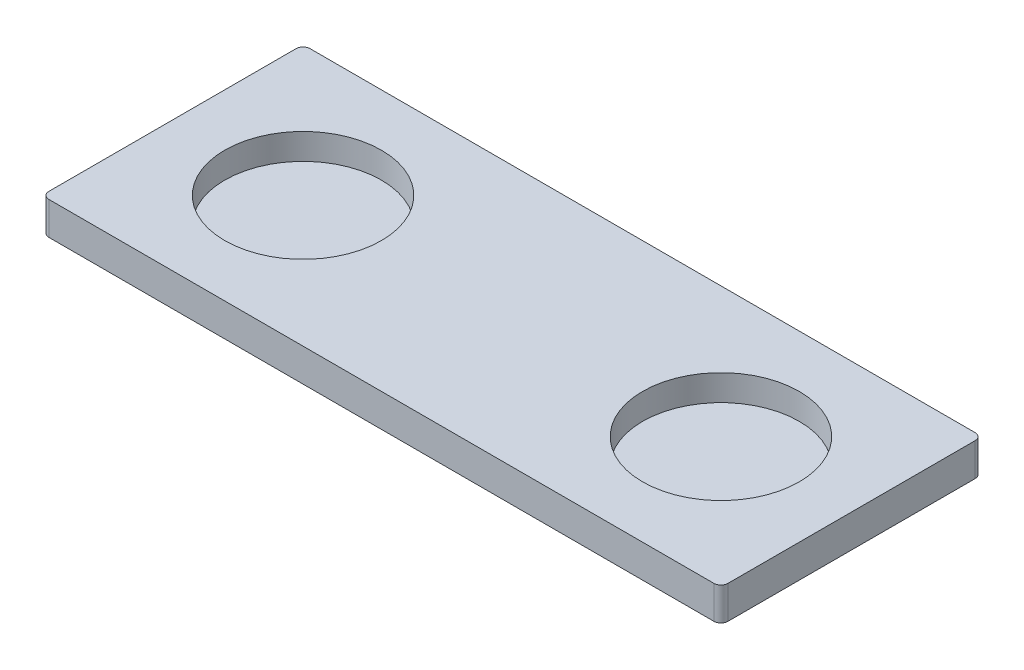
ISO-10303-21;
HEADER;
FILE_DESCRIPTION(('STEP AP214'),'2;1');
FILE_NAME('part.step','',(''),(''),'','','');
FILE_SCHEMA(('AUTOMOTIVE_DESIGN { 1 0 10303 214 1 1 1 1 }'));
ENDSEC;
DATA;
#1=APPLICATION_CONTEXT('core data for automotive mechanical design processes');
#2=APPLICATION_PROTOCOL_DEFINITION('international standard','automotive_design',2000,#1);
#3=PRODUCT_CONTEXT('',#1,'mechanical');
#4=PRODUCT('Part','Part','',(#3));
#5=PRODUCT_RELATED_PRODUCT_CATEGORY('part','',(#4));
#6=PRODUCT_DEFINITION_FORMATION('','',#4);
#7=PRODUCT_DEFINITION_CONTEXT('part definition',#1,'design');
#8=PRODUCT_DEFINITION('design','',#6,#7);
#9=PRODUCT_DEFINITION_SHAPE('','',#8);
#10=(LENGTH_UNIT() NAMED_UNIT(*) SI_UNIT(.MILLI.,.METRE.));
#11=(NAMED_UNIT(*) PLANE_ANGLE_UNIT() SI_UNIT($,.RADIAN.));
#12=(NAMED_UNIT(*) SI_UNIT($,.STERADIAN.) SOLID_ANGLE_UNIT());
#13=UNCERTAINTY_MEASURE_WITH_UNIT(LENGTH_MEASURE(1.E-05),#10,'distance_accuracy_value','');
#14=(GEOMETRIC_REPRESENTATION_CONTEXT(3) GLOBAL_UNCERTAINTY_ASSIGNED_CONTEXT((#13)) GLOBAL_UNIT_ASSIGNED_CONTEXT((#10,
#11,#12)) REPRESENTATION_CONTEXT('',''));
#15=CARTESIAN_POINT('',(0.,0.,0.));
#16=DIRECTION('',(0.,0.,1.));
#17=DIRECTION('',(1.,0.,0.));
#18=AXIS2_PLACEMENT_3D('',#15,#16,#17);
#19=CARTESIAN_POINT('',(76.2,2.54,0.));
#20=DIRECTION('',(0.,-1.,0.));
#21=DIRECTION('',(0.,0.,-1.));
#22=AXIS2_PLACEMENT_3D('',#19,#20,#21);
#23=PLANE('',#22);
#24=CARTESIAN_POINT('',(76.2,2.54,0.));
#25=DIRECTION('',(0.,1.,0.));
#26=DIRECTION('',(0.,0.,1.));
#27=AXIS2_PLACEMENT_3D('',#24,#25,#26);
#28=CIRCLE('',#27,28.575);
#29=CARTESIAN_POINT('',(76.2,2.54,28.575));
#30=VERTEX_POINT('',#29);
#31=EDGE_CURVE('E19',#30,#30,#28,.T.);
#32=ORIENTED_EDGE('',*,*,#31,.T.);
#33=EDGE_LOOP('',(#32));
#34=FACE_BOUND('',#33,.T.);
#35=ADVANCED_FACE('F16',(#34),#23,.F.);
#36=CARTESIAN_POINT('',(-76.2,2.54,0.));
#37=DIRECTION('',(0.,-1.,0.));
#38=DIRECTION('',(0.,0.,-1.));
#39=AXIS2_PLACEMENT_3D('',#36,#37,#38);
#40=PLANE('',#39);
#41=CARTESIAN_POINT('',(-76.2,2.54,0.));
#42=DIRECTION('',(0.,1.,0.));
#43=DIRECTION('',(0.,0.,1.));
#44=AXIS2_PLACEMENT_3D('',#41,#42,#43);
#45=CIRCLE('',#44,28.575);
#46=CARTESIAN_POINT('',(-76.2,2.54,28.575));
#47=VERTEX_POINT('',#46);
#48=EDGE_CURVE('E139',#47,#47,#45,.T.);
#49=ORIENTED_EDGE('',*,*,#48,.T.);
#50=EDGE_LOOP('',(#49));
#51=FACE_BOUND('',#50,.T.);
#52=ADVANCED_FACE('F150',(#51),#40,.F.);
#53=CARTESIAN_POINT('',(76.2,0.,0.));
#54=DIRECTION('',(0.,1.,0.));
#55=DIRECTION('',(0.,0.,1.));
#56=AXIS2_PLACEMENT_3D('',#53,#54,#55);
#57=CYLINDRICAL_SURFACE('',#56,28.575);
#58=CARTESIAN_POINT('',(76.2,12.,0.));
#59=DIRECTION('',(0.,1.,0.));
#60=DIRECTION('',(0.,0.,1.));
#61=AXIS2_PLACEMENT_3D('',#58,#59,#60);
#62=CIRCLE('',#61,28.575);
#63=CARTESIAN_POINT('',(76.2,12.,28.575));
#64=VERTEX_POINT('',#63);
#65=EDGE_CURVE('E137',#64,#64,#62,.F.);
#66=ORIENTED_EDGE('',*,*,#65,.F.);
#67=EDGE_LOOP('',(#66));
#68=FACE_BOUND('',#67,.T.);
#69=ORIENTED_EDGE('',*,*,#31,.F.);
#70=EDGE_LOOP('',(#69));
#71=FACE_BOUND('',#70,.T.);
#72=ADVANCED_FACE('F147',(#68,#71),#57,.F.);
#73=CARTESIAN_POINT('',(-76.2,0.,0.));
#74=DIRECTION('',(0.,1.,0.));
#75=DIRECTION('',(0.,0.,1.));
#76=AXIS2_PLACEMENT_3D('',#73,#74,#75);
#77=CYLINDRICAL_SURFACE('',#76,28.575);
#78=CARTESIAN_POINT('',(-76.2,12.,0.));
#79=DIRECTION('',(0.,1.,0.));
#80=DIRECTION('',(0.,0.,1.));
#81=AXIS2_PLACEMENT_3D('',#78,#79,#80);
#82=CIRCLE('',#81,28.575);
#83=CARTESIAN_POINT('',(-76.2,12.,28.575));
#84=VERTEX_POINT('',#83);
#85=EDGE_CURVE('E92',#84,#84,#82,.F.);
#86=ORIENTED_EDGE('',*,*,#85,.F.);
#87=EDGE_LOOP('',(#86));
#88=FACE_BOUND('',#87,.T.);
#89=ORIENTED_EDGE('',*,*,#48,.F.);
#90=EDGE_LOOP('',(#89));
#91=FACE_BOUND('',#90,.T.);
#92=ADVANCED_FACE('F149',(#88,#91),#77,.F.);
#93=CARTESIAN_POINT('',(0.,12.,0.));
#94=DIRECTION('',(0.,1.,0.));
#95=DIRECTION('',(0.,0.,1.));
#96=AXIS2_PLACEMENT_3D('',#93,#94,#95);
#97=PLANE('',#96);
#98=DIRECTION('',(0.,0.,1.));
#99=VECTOR('',#98,1.);
#100=CARTESIAN_POINT('',(123.825,12.,47.625));
#101=LINE('',#100,#99);
#102=CARTESIAN_POINT('',(123.825,12.,45.085));
#103=VERTEX_POINT('',#102);
#104=CARTESIAN_POINT('',(123.825,12.,-45.085));
#105=VERTEX_POINT('',#104);
#106=EDGE_CURVE('E114',#103,#105,#101,.F.);
#107=ORIENTED_EDGE('',*,*,#106,.T.);
#108=CARTESIAN_POINT('',(121.285,12.,-45.085));
#109=DIRECTION('',(0.,-1.,0.));
#110=DIRECTION('',(0.,0.,-1.));
#111=AXIS2_PLACEMENT_3D('',#108,#109,#110);
#112=CIRCLE('',#111,2.54);
#113=CARTESIAN_POINT('',(121.285,12.,-47.625));
#114=VERTEX_POINT('',#113);
#115=EDGE_CURVE('E115',#114,#105,#112,.T.);
#116=ORIENTED_EDGE('',*,*,#115,.F.);
#117=DIRECTION('',(1.,0.,0.));
#118=VECTOR('',#117,1.);
#119=CARTESIAN_POINT('',(123.825,12.,-47.625));
#120=LINE('',#119,#118);
#121=CARTESIAN_POINT('',(-121.285,12.,-47.625));
#122=VERTEX_POINT('',#121);
#123=EDGE_CURVE('E109',#114,#122,#120,.F.);
#124=ORIENTED_EDGE('',*,*,#123,.T.);
#125=CARTESIAN_POINT('',(-121.285,12.,-45.085));
#126=DIRECTION('',(0.,-1.,0.));
#127=DIRECTION('',(0.,0.,-1.));
#128=AXIS2_PLACEMENT_3D('',#125,#126,#127);
#129=CIRCLE('',#128,2.54);
#130=CARTESIAN_POINT('',(-123.825,12.,-45.085));
#131=VERTEX_POINT('',#130);
#132=EDGE_CURVE('E112',#131,#122,#129,.T.);
#133=ORIENTED_EDGE('',*,*,#132,.F.);
#134=DIRECTION('',(0.,0.,-1.));
#135=VECTOR('',#134,1.);
#136=CARTESIAN_POINT('',(-123.825,12.,47.625));
#137=LINE('',#136,#135);
#138=CARTESIAN_POINT('',(-123.825,12.,45.085));
#139=VERTEX_POINT('',#138);
#140=EDGE_CURVE('E86',#131,#139,#137,.F.);
#141=ORIENTED_EDGE('',*,*,#140,.T.);
#142=CARTESIAN_POINT('',(-121.285,12.,45.085));
#143=DIRECTION('',(0.,-1.,0.));
#144=DIRECTION('',(0.,0.,-1.));
#145=AXIS2_PLACEMENT_3D('',#142,#143,#144);
#146=CIRCLE('',#145,2.54);
#147=CARTESIAN_POINT('',(-121.285,12.,47.625));
#148=VERTEX_POINT('',#147);
#149=EDGE_CURVE('E79',#148,#139,#146,.T.);
#150=ORIENTED_EDGE('',*,*,#149,.F.);
#151=DIRECTION('',(-1.,0.,0.));
#152=VECTOR('',#151,1.);
#153=CARTESIAN_POINT('',(123.825,12.,47.625));
#154=LINE('',#153,#152);
#155=CARTESIAN_POINT('',(121.285,12.,47.625));
#156=VERTEX_POINT('',#155);
#157=EDGE_CURVE('E84',#148,#156,#154,.F.);
#158=ORIENTED_EDGE('',*,*,#157,.T.);
#159=CARTESIAN_POINT('',(121.285,12.,45.085));
#160=DIRECTION('',(0.,-1.,0.));
#161=DIRECTION('',(0.,0.,-1.));
#162=AXIS2_PLACEMENT_3D('',#159,#160,#161);
#163=CIRCLE('',#162,2.54);
#164=EDGE_CURVE('E99',#103,#156,#163,.T.);
#165=ORIENTED_EDGE('',*,*,#164,.F.);
#166=EDGE_LOOP('',(#107,#116,#124,#133,#141,#150,#158,#165));
#167=FACE_BOUND('',#166,.T.);
#168=ORIENTED_EDGE('',*,*,#85,.T.);
#169=EDGE_LOOP('',(#168));
#170=FACE_BOUND('',#169,.T.);
#171=ORIENTED_EDGE('',*,*,#65,.T.);
#172=EDGE_LOOP('',(#171));
#173=FACE_BOUND('',#172,.T.);
#174=ADVANCED_FACE('F82',(#167,#170,#173),#97,.T.);
#175=CARTESIAN_POINT('',(-121.285,12.,45.085));
#176=DIRECTION('',(0.,-1.,0.));
#177=DIRECTION('',(0.,0.,-1.));
#178=AXIS2_PLACEMENT_3D('',#175,#176,#177);
#179=CYLINDRICAL_SURFACE('',#178,2.54);
#180=CARTESIAN_POINT('',(-121.285,0.,45.085));
#181=DIRECTION('',(0.,-1.,0.));
#182=DIRECTION('',(0.,0.,-1.));
#183=AXIS2_PLACEMENT_3D('',#180,#181,#182);
#184=CIRCLE('',#183,2.54);
#185=CARTESIAN_POINT('',(-123.825,0.,45.085));
#186=VERTEX_POINT('',#185);
#187=CARTESIAN_POINT('',(-121.285,0.,47.625));
#188=VERTEX_POINT('',#187);
#189=EDGE_CURVE('E103',#186,#188,#184,.F.);
#190=ORIENTED_EDGE('',*,*,#189,.T.);
#191=DIRECTION('',(0.,1.,0.));
#192=VECTOR('',#191,1.);
#193=CARTESIAN_POINT('',(-121.285,12.,47.625));
#194=LINE('',#193,#192);
#195=EDGE_CURVE('E91',#188,#148,#194,.T.);
#196=ORIENTED_EDGE('',*,*,#195,.T.);
#197=ORIENTED_EDGE('',*,*,#149,.T.);
#198=DIRECTION('',(0.,1.,0.));
#199=VECTOR('',#198,1.);
#200=CARTESIAN_POINT('',(-123.825,12.,45.085));
#201=LINE('',#200,#199);
#202=EDGE_CURVE('E300',#139,#186,#201,.F.);
#203=ORIENTED_EDGE('',*,*,#202,.T.);
#204=EDGE_LOOP('',(#190,#196,#197,#203));
#205=FACE_BOUND('',#204,.T.);
#206=ADVANCED_FACE('F102',(#205),#179,.T.);
#207=CARTESIAN_POINT('',(123.825,12.,47.625));
#208=DIRECTION('',(0.,0.,-1.));
#209=DIRECTION('',(-1.,0.,0.));
#210=AXIS2_PLACEMENT_3D('',#207,#208,#209);
#211=PLANE('',#210);
#212=ORIENTED_EDGE('',*,*,#195,.F.);
#213=DIRECTION('',(1.,0.,0.));
#214=VECTOR('',#213,1.);
#215=CARTESIAN_POINT('',(0.,0.,47.625));
#216=LINE('',#215,#214);
#217=CARTESIAN_POINT('',(121.285,0.,47.625));
#218=VERTEX_POINT('',#217);
#219=EDGE_CURVE('E128',#188,#218,#216,.T.);
#220=ORIENTED_EDGE('',*,*,#219,.T.);
#221=DIRECTION('',(0.,-1.,0.));
#222=VECTOR('',#221,1.);
#223=CARTESIAN_POINT('',(121.285,12.,47.625));
#224=LINE('',#223,#222);
#225=EDGE_CURVE('E98',#156,#218,#224,.T.);
#226=ORIENTED_EDGE('',*,*,#225,.F.);
#227=ORIENTED_EDGE('',*,*,#157,.F.);
#228=EDGE_LOOP('',(#212,#220,#226,#227));
#229=FACE_BOUND('',#228,.T.);
#230=ADVANCED_FACE('F95',(#229),#211,.F.);
#231=CARTESIAN_POINT('',(121.285,12.,45.085));
#232=DIRECTION('',(0.,-1.,0.));
#233=DIRECTION('',(0.,0.,-1.));
#234=AXIS2_PLACEMENT_3D('',#231,#232,#233);
#235=CYLINDRICAL_SURFACE('',#234,2.54);
#236=CARTESIAN_POINT('',(121.285,0.,45.085));
#237=DIRECTION('',(0.,-1.,0.));
#238=DIRECTION('',(0.,0.,-1.));
#239=AXIS2_PLACEMENT_3D('',#236,#237,#238);
#240=CIRCLE('',#239,2.54);
#241=CARTESIAN_POINT('',(123.825,0.,45.085));
#242=VERTEX_POINT('',#241);
#243=EDGE_CURVE('E125',#218,#242,#240,.F.);
#244=ORIENTED_EDGE('',*,*,#243,.T.);
#245=DIRECTION('',(0.,1.,0.));
#246=VECTOR('',#245,1.);
#247=CARTESIAN_POINT('',(123.825,12.,45.085));
#248=LINE('',#247,#246);
#249=EDGE_CURVE('E116',#242,#103,#248,.T.);
#250=ORIENTED_EDGE('',*,*,#249,.T.);
#251=ORIENTED_EDGE('',*,*,#164,.T.);
#252=ORIENTED_EDGE('',*,*,#225,.T.);
#253=EDGE_LOOP('',(#244,#250,#251,#252));
#254=FACE_BOUND('',#253,.T.);
#255=ADVANCED_FACE('F187',(#254),#235,.T.);
#256=CARTESIAN_POINT('',(123.825,12.,47.625));
#257=DIRECTION('',(-1.,0.,0.));
#258=DIRECTION('',(0.,0.,1.));
#259=AXIS2_PLACEMENT_3D('',#256,#257,#258);
#260=PLANE('',#259);
#261=DIRECTION('',(0.,-1.,0.));
#262=VECTOR('',#261,1.);
#263=CARTESIAN_POINT('',(123.825,12.,-45.085));
#264=LINE('',#263,#262);
#265=CARTESIAN_POINT('',(123.825,0.,-45.085));
#266=VERTEX_POINT('',#265);
#267=EDGE_CURVE('E133',#105,#266,#264,.T.);
#268=ORIENTED_EDGE('',*,*,#267,.F.);
#269=ORIENTED_EDGE('',*,*,#106,.F.);
#270=ORIENTED_EDGE('',*,*,#249,.F.);
#271=DIRECTION('',(0.,0.,1.));
#272=VECTOR('',#271,1.);
#273=CARTESIAN_POINT('',(123.825,0.,0.));
#274=LINE('',#273,#272);
#275=EDGE_CURVE('E124',#242,#266,#274,.F.);
#276=ORIENTED_EDGE('',*,*,#275,.T.);
#277=EDGE_LOOP('',(#268,#269,#270,#276));
#278=FACE_BOUND('',#277,.T.);
#279=ADVANCED_FACE('F183',(#278),#260,.F.);
#280=CARTESIAN_POINT('',(121.285,12.,-45.085));
#281=DIRECTION('',(0.,-1.,0.));
#282=DIRECTION('',(0.,0.,-1.));
#283=AXIS2_PLACEMENT_3D('',#280,#281,#282);
#284=CYLINDRICAL_SURFACE('',#283,2.54);
#285=CARTESIAN_POINT('',(121.285,0.,-45.085));
#286=DIRECTION('',(0.,-1.,0.));
#287=DIRECTION('',(0.,0.,-1.));
#288=AXIS2_PLACEMENT_3D('',#285,#286,#287);
#289=CIRCLE('',#288,2.54);
#290=CARTESIAN_POINT('',(121.285,0.,-47.625));
#291=VERTEX_POINT('',#290);
#292=EDGE_CURVE('E121',#266,#291,#289,.F.);
#293=ORIENTED_EDGE('',*,*,#292,.T.);
#294=DIRECTION('',(0.,1.,0.));
#295=VECTOR('',#294,1.);
#296=CARTESIAN_POINT('',(121.285,12.,-47.625));
#297=LINE('',#296,#295);
#298=EDGE_CURVE('E113',#291,#114,#297,.T.);
#299=ORIENTED_EDGE('',*,*,#298,.T.);
#300=ORIENTED_EDGE('',*,*,#115,.T.);
#301=ORIENTED_EDGE('',*,*,#267,.T.);
#302=EDGE_LOOP('',(#293,#299,#300,#301));
#303=FACE_BOUND('',#302,.T.);
#304=ADVANCED_FACE('F179',(#303),#284,.T.);
#305=CARTESIAN_POINT('',(123.825,12.,-47.625));
#306=DIRECTION('',(0.,0.,1.));
#307=DIRECTION('',(1.,0.,0.));
#308=AXIS2_PLACEMENT_3D('',#305,#306,#307);
#309=PLANE('',#308);
#310=DIRECTION('',(0.,-1.,0.));
#311=VECTOR('',#310,1.);
#312=CARTESIAN_POINT('',(-121.285,12.,-47.625));
#313=LINE('',#312,#311);
#314=CARTESIAN_POINT('',(-121.285,0.,-47.625));
#315=VERTEX_POINT('',#314);
#316=EDGE_CURVE('E131',#122,#315,#313,.T.);
#317=ORIENTED_EDGE('',*,*,#316,.F.);
#318=ORIENTED_EDGE('',*,*,#123,.F.);
#319=ORIENTED_EDGE('',*,*,#298,.F.);
#320=DIRECTION('',(1.,0.,0.));
#321=VECTOR('',#320,1.);
#322=CARTESIAN_POINT('',(0.,0.,-47.625));
#323=LINE('',#322,#321);
#324=EDGE_CURVE('E120',#291,#315,#323,.F.);
#325=ORIENTED_EDGE('',*,*,#324,.T.);
#326=EDGE_LOOP('',(#317,#318,#319,#325));
#327=FACE_BOUND('',#326,.T.);
#328=ADVANCED_FACE('F175',(#327),#309,.F.);
#329=CARTESIAN_POINT('',(-121.285,12.,-45.085));
#330=DIRECTION('',(0.,-1.,0.));
#331=DIRECTION('',(0.,0.,-1.));
#332=AXIS2_PLACEMENT_3D('',#329,#330,#331);
#333=CYLINDRICAL_SURFACE('',#332,2.54);
#334=CARTESIAN_POINT('',(-121.285,0.,-45.085));
#335=DIRECTION('',(0.,-1.,0.));
#336=DIRECTION('',(0.,0.,-1.));
#337=AXIS2_PLACEMENT_3D('',#334,#335,#336);
#338=CIRCLE('',#337,2.54);
#339=CARTESIAN_POINT('',(-123.825,0.,-45.085));
#340=VERTEX_POINT('',#339);
#341=EDGE_CURVE('E25',#315,#340,#338,.F.);
#342=ORIENTED_EDGE('',*,*,#341,.T.);
#343=DIRECTION('',(0.,1.,0.));
#344=VECTOR('',#343,1.);
#345=CARTESIAN_POINT('',(-123.825,12.,-45.085));
#346=LINE('',#345,#344);
#347=EDGE_CURVE('E33',#340,#131,#346,.T.);
#348=ORIENTED_EDGE('',*,*,#347,.T.);
#349=ORIENTED_EDGE('',*,*,#132,.T.);
#350=ORIENTED_EDGE('',*,*,#316,.T.);
#351=EDGE_LOOP('',(#342,#348,#349,#350));
#352=FACE_BOUND('',#351,.T.);
#353=ADVANCED_FACE('F169',(#352),#333,.T.);
#354=CARTESIAN_POINT('',(-123.825,12.,47.625));
#355=DIRECTION('',(1.,0.,0.));
#356=DIRECTION('',(0.,0.,-1.));
#357=AXIS2_PLACEMENT_3D('',#354,#355,#356);
#358=PLANE('',#357);
#359=ORIENTED_EDGE('',*,*,#347,.F.);
#360=DIRECTION('',(0.,0.,1.));
#361=VECTOR('',#360,1.);
#362=CARTESIAN_POINT('',(-123.825,0.,0.));
#363=LINE('',#362,#361);
#364=EDGE_CURVE('E11',#340,#186,#363,.T.);
#365=ORIENTED_EDGE('',*,*,#364,.T.);
#366=ORIENTED_EDGE('',*,*,#202,.F.);
#367=ORIENTED_EDGE('',*,*,#140,.F.);
#368=EDGE_LOOP('',(#359,#365,#366,#367));
#369=FACE_BOUND('',#368,.T.);
#370=ADVANCED_FACE('F163',(#369),#358,.F.);
#371=CARTESIAN_POINT('',(0.,0.,0.));
#372=DIRECTION('',(0.,1.,0.));
#373=DIRECTION('',(0.,0.,1.));
#374=AXIS2_PLACEMENT_3D('',#371,#372,#373);
#375=PLANE('',#374);
#376=ORIENTED_EDGE('',*,*,#341,.F.);
#377=ORIENTED_EDGE('',*,*,#324,.F.);
#378=ORIENTED_EDGE('',*,*,#292,.F.);
#379=ORIENTED_EDGE('',*,*,#275,.F.);
#380=ORIENTED_EDGE('',*,*,#243,.F.);
#381=ORIENTED_EDGE('',*,*,#219,.F.);
#382=ORIENTED_EDGE('',*,*,#189,.F.);
#383=ORIENTED_EDGE('',*,*,#364,.F.);
#384=EDGE_LOOP('',(#376,#377,#378,#379,#380,#381,#382,#383));
#385=FACE_BOUND('',#384,.T.);
#386=ADVANCED_FACE('F161',(#385),#375,.F.);
#387=CLOSED_SHELL('',(#35,#52,#72,#92,#174,#206,#230,#255,#279,#304,#328,#353,#370,#386));
#388=MANIFOLD_SOLID_BREP('B1',#387);
#389=ADVANCED_BREP_SHAPE_REPRESENTATION('',(#18,#388),#14);
#390=SHAPE_DEFINITION_REPRESENTATION(#9,#389);
ENDSEC;
END-ISO-10303-21;
